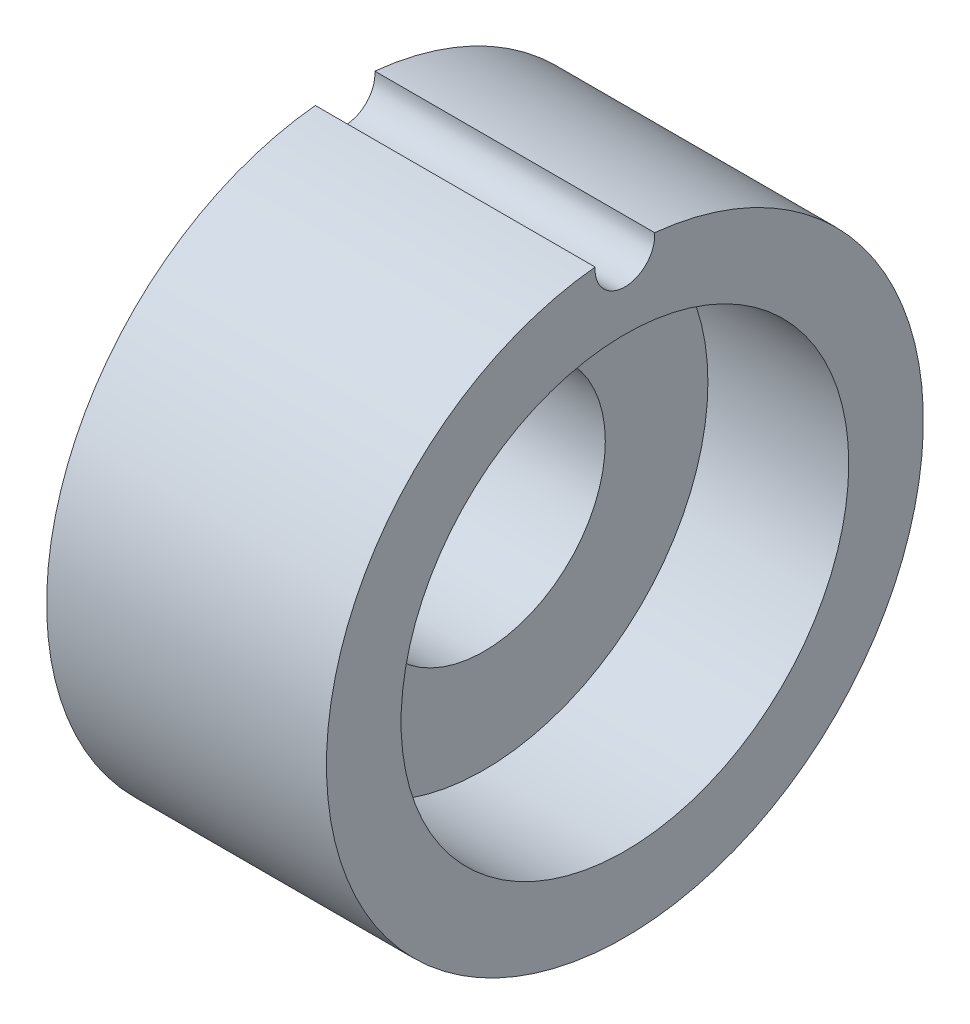
ISO-10303-21;
HEADER;
FILE_DESCRIPTION(('STEP AP214'),'2;1');
FILE_NAME('part.step','',(''),(''),'','','');
FILE_SCHEMA(('AUTOMOTIVE_DESIGN { 1 0 10303 214 1 1 1 1 }'));
ENDSEC;
DATA;
#1=APPLICATION_CONTEXT('core data for automotive mechanical design processes');
#2=APPLICATION_PROTOCOL_DEFINITION('international standard','automotive_design',2000,#1);
#3=PRODUCT_CONTEXT('',#1,'mechanical');
#4=PRODUCT('Part','Part','',(#3));
#5=PRODUCT_RELATED_PRODUCT_CATEGORY('part','',(#4));
#6=PRODUCT_DEFINITION_FORMATION('','',#4);
#7=PRODUCT_DEFINITION_CONTEXT('part definition',#1,'design');
#8=PRODUCT_DEFINITION('design','',#6,#7);
#9=PRODUCT_DEFINITION_SHAPE('','',#8);
#10=(LENGTH_UNIT() NAMED_UNIT(*) SI_UNIT(.MILLI.,.METRE.));
#11=(NAMED_UNIT(*) PLANE_ANGLE_UNIT() SI_UNIT($,.RADIAN.));
#12=(NAMED_UNIT(*) SI_UNIT($,.STERADIAN.) SOLID_ANGLE_UNIT());
#13=UNCERTAINTY_MEASURE_WITH_UNIT(LENGTH_MEASURE(1.E-05),#10,'distance_accuracy_value','');
#14=(GEOMETRIC_REPRESENTATION_CONTEXT(3) GLOBAL_UNCERTAINTY_ASSIGNED_CONTEXT((#13)) GLOBAL_UNIT_ASSIGNED_CONTEXT((#10,
#11,#12)) REPRESENTATION_CONTEXT('',''));
#15=CARTESIAN_POINT('',(0.,0.,0.));
#16=DIRECTION('',(0.,0.,1.));
#17=DIRECTION('',(1.,0.,0.));
#18=AXIS2_PLACEMENT_3D('',#15,#16,#17);
#19=CARTESIAN_POINT('',(7.5,0.,0.));
#20=DIRECTION('',(-1.,0.,0.));
#21=DIRECTION('',(0.,0.,1.));
#22=AXIS2_PLACEMENT_3D('',#19,#20,#21);
#23=CYLINDRICAL_SURFACE('',#22,3.25);
#24=CARTESIAN_POINT('',(0.,0.,0.));
#25=DIRECTION('',(1.,0.,0.));
#26=DIRECTION('',(0.,0.,-1.));
#27=AXIS2_PLACEMENT_3D('',#24,#25,#26);
#28=CIRCLE('',#27,3.25);
#29=CARTESIAN_POINT('',(0.,0.,-3.25));
#30=VERTEX_POINT('',#29);
#31=EDGE_CURVE('E72',#30,#30,#28,.T.);
#32=ORIENTED_EDGE('',*,*,#31,.F.);
#33=EDGE_LOOP('',(#32));
#34=FACE_BOUND('',#33,.T.);
#35=CARTESIAN_POINT('',(3.725,0.,0.));
#36=DIRECTION('',(1.,0.,0.));
#37=DIRECTION('',(0.,0.,-1.));
#38=AXIS2_PLACEMENT_3D('',#35,#36,#37);
#39=CIRCLE('',#38,3.25);
#40=CARTESIAN_POINT('',(3.725,0.,-3.25));
#41=VERTEX_POINT('',#40);
#42=EDGE_CURVE('E77',#41,#41,#39,.T.);
#43=ORIENTED_EDGE('',*,*,#42,.T.);
#44=EDGE_LOOP('',(#43));
#45=FACE_BOUND('',#44,.T.);
#46=ADVANCED_FACE('F35',(#34,#45),#23,.F.);
#47=CARTESIAN_POINT('',(7.5,0.,0.));
#48=DIRECTION('',(1.,0.,0.));
#49=DIRECTION('',(0.,0.,-1.));
#50=AXIS2_PLACEMENT_3D('',#47,#48,#49);
#51=PLANE('',#50);
#52=CARTESIAN_POINT('',(7.5,7.9,0.));
#53=DIRECTION('',(1.,0.,0.));
#54=DIRECTION('',(0.,0.,-1.));
#55=AXIS2_PLACEMENT_3D('',#52,#53,#54);
#56=CIRCLE('',#55,0.8);
#57=CARTESIAN_POINT('',(7.5,7.96012658227848,0.797737296422519));
#58=VERTEX_POINT('',#57);
#59=CARTESIAN_POINT('',(7.5,7.96012658227848,-0.797737296422519));
#60=VERTEX_POINT('',#59);
#61=EDGE_CURVE('E58',#58,#60,#56,.T.);
#62=ORIENTED_EDGE('',*,*,#61,.F.);
#63=CARTESIAN_POINT('',(7.5,0.,0.));
#64=DIRECTION('',(1.,0.,0.));
#65=DIRECTION('',(0.,0.,-1.));
#66=AXIS2_PLACEMENT_3D('',#63,#64,#65);
#67=CIRCLE('',#66,8.);
#68=EDGE_CURVE('E66',#58,#60,#67,.T.);
#69=ORIENTED_EDGE('',*,*,#68,.T.);
#70=EDGE_LOOP('',(#62,#69));
#71=FACE_BOUND('',#70,.T.);
#72=CARTESIAN_POINT('',(7.5,0.,0.));
#73=DIRECTION('',(1.,0.,0.));
#74=DIRECTION('',(0.,0.,-1.));
#75=AXIS2_PLACEMENT_3D('',#72,#73,#74);
#76=CIRCLE('',#75,6.);
#77=CARTESIAN_POINT('',(7.5,0.,-6.));
#78=VERTEX_POINT('',#77);
#79=EDGE_CURVE('E84',#78,#78,#76,.T.);
#80=ORIENTED_EDGE('',*,*,#79,.F.);
#81=EDGE_LOOP('',(#80));
#82=FACE_BOUND('',#81,.T.);
#83=ADVANCED_FACE('F69',(#71,#82),#51,.T.);
#84=CARTESIAN_POINT('',(0.,0.,0.));
#85=DIRECTION('',(1.,0.,0.));
#86=DIRECTION('',(0.,0.,-1.));
#87=AXIS2_PLACEMENT_3D('',#84,#85,#86);
#88=PLANE('',#87);
#89=CARTESIAN_POINT('',(0.,0.,0.));
#90=DIRECTION('',(1.,0.,0.));
#91=DIRECTION('',(0.,0.,-1.));
#92=AXIS2_PLACEMENT_3D('',#89,#90,#91);
#93=CIRCLE('',#92,8.);
#94=CARTESIAN_POINT('',(0.,7.96012658227848,0.797737296422519));
#95=VERTEX_POINT('',#94);
#96=CARTESIAN_POINT('',(0.,7.96012658227848,-0.797737296422526));
#97=VERTEX_POINT('',#96);
#98=EDGE_CURVE('E68',#95,#97,#93,.T.);
#99=ORIENTED_EDGE('',*,*,#98,.F.);
#100=CARTESIAN_POINT('',(0.,7.9,0.));
#101=DIRECTION('',(1.,0.,0.));
#102=DIRECTION('',(0.,0.,-1.));
#103=AXIS2_PLACEMENT_3D('',#100,#101,#102);
#104=CIRCLE('',#103,0.8);
#105=EDGE_CURVE('E50',#95,#97,#104,.T.);
#106=ORIENTED_EDGE('',*,*,#105,.T.);
#107=EDGE_LOOP('',(#99,#106));
#108=FACE_BOUND('',#107,.T.);
#109=ORIENTED_EDGE('',*,*,#31,.T.);
#110=EDGE_LOOP('',(#109));
#111=FACE_BOUND('',#110,.T.);
#112=ADVANCED_FACE('F91',(#108,#111),#88,.F.);
#113=CARTESIAN_POINT('',(7.5,0.,0.));
#114=DIRECTION('',(-1.,0.,0.));
#115=DIRECTION('',(0.,0.,1.));
#116=AXIS2_PLACEMENT_3D('',#113,#114,#115);
#117=CYLINDRICAL_SURFACE('',#116,8.);
#118=ORIENTED_EDGE('',*,*,#98,.T.);
#119=DIRECTION('',(1.,0.,0.));
#120=VECTOR('',#119,1.);
#121=CARTESIAN_POINT('',(2.5,7.96012658227848,-0.797737296422519));
#122=LINE('',#121,#120);
#123=EDGE_CURVE('E11',#97,#60,#122,.T.);
#124=ORIENTED_EDGE('',*,*,#123,.T.);
#125=ORIENTED_EDGE('',*,*,#68,.F.);
#126=DIRECTION('',(1.,0.,0.));
#127=VECTOR('',#126,1.);
#128=CARTESIAN_POINT('',(2.5,7.96012658227848,0.797737296422519));
#129=LINE('',#128,#127);
#130=EDGE_CURVE('E43',#58,#95,#129,.F.);
#131=ORIENTED_EDGE('',*,*,#130,.T.);
#132=EDGE_LOOP('',(#118,#124,#125,#131));
#133=FACE_BOUND('',#132,.T.);
#134=ADVANCED_FACE('F37',(#133),#117,.T.);
#135=CARTESIAN_POINT('',(3.725,0.,0.));
#136=DIRECTION('',(1.,0.,0.));
#137=DIRECTION('',(0.,0.,-1.));
#138=AXIS2_PLACEMENT_3D('',#135,#136,#137);
#139=CYLINDRICAL_SURFACE('',#138,6.);
#140=CARTESIAN_POINT('',(3.725,0.,0.));
#141=DIRECTION('',(1.,0.,0.));
#142=DIRECTION('',(0.,0.,-1.));
#143=AXIS2_PLACEMENT_3D('',#140,#141,#142);
#144=CIRCLE('',#143,6.);
#145=CARTESIAN_POINT('',(3.725,0.,-6.));
#146=VERTEX_POINT('',#145);
#147=EDGE_CURVE('E79',#146,#146,#144,.T.);
#148=ORIENTED_EDGE('',*,*,#147,.F.);
#149=EDGE_LOOP('',(#148));
#150=FACE_BOUND('',#149,.T.);
#151=ORIENTED_EDGE('',*,*,#79,.T.);
#152=EDGE_LOOP('',(#151));
#153=FACE_BOUND('',#152,.T.);
#154=ADVANCED_FACE('F104',(#150,#153),#139,.F.);
#155=CARTESIAN_POINT('',(3.725,0.,0.));
#156=DIRECTION('',(1.,0.,0.));
#157=DIRECTION('',(0.,0.,-1.));
#158=AXIS2_PLACEMENT_3D('',#155,#156,#157);
#159=PLANE('',#158);
#160=ORIENTED_EDGE('',*,*,#42,.F.);
#161=EDGE_LOOP('',(#160));
#162=FACE_BOUND('',#161,.T.);
#163=ORIENTED_EDGE('',*,*,#147,.T.);
#164=EDGE_LOOP('',(#163));
#165=FACE_BOUND('',#164,.T.);
#166=ADVANCED_FACE('F107',(#162,#165),#159,.T.);
#167=CARTESIAN_POINT('',(-2.5,7.9,0.));
#168=DIRECTION('',(1.,0.,0.));
#169=DIRECTION('',(0.,0.,-1.));
#170=AXIS2_PLACEMENT_3D('',#167,#168,#169);
#171=CYLINDRICAL_SURFACE('',#170,0.8);
#172=ORIENTED_EDGE('',*,*,#105,.F.);
#173=ORIENTED_EDGE('',*,*,#130,.F.);
#174=ORIENTED_EDGE('',*,*,#61,.T.);
#175=ORIENTED_EDGE('',*,*,#123,.F.);
#176=EDGE_LOOP('',(#172,#173,#174,#175));
#177=FACE_BOUND('',#176,.T.);
#178=ADVANCED_FACE('F59',(#177),#171,.F.);
#179=CLOSED_SHELL('',(#46,#83,#112,#134,#154,#166,#178));
#180=MANIFOLD_SOLID_BREP('B2',#179);
#181=ADVANCED_BREP_SHAPE_REPRESENTATION('',(#18,#180),#14);
#182=SHAPE_DEFINITION_REPRESENTATION(#9,#181);
ENDSEC;
END-ISO-10303-21;
